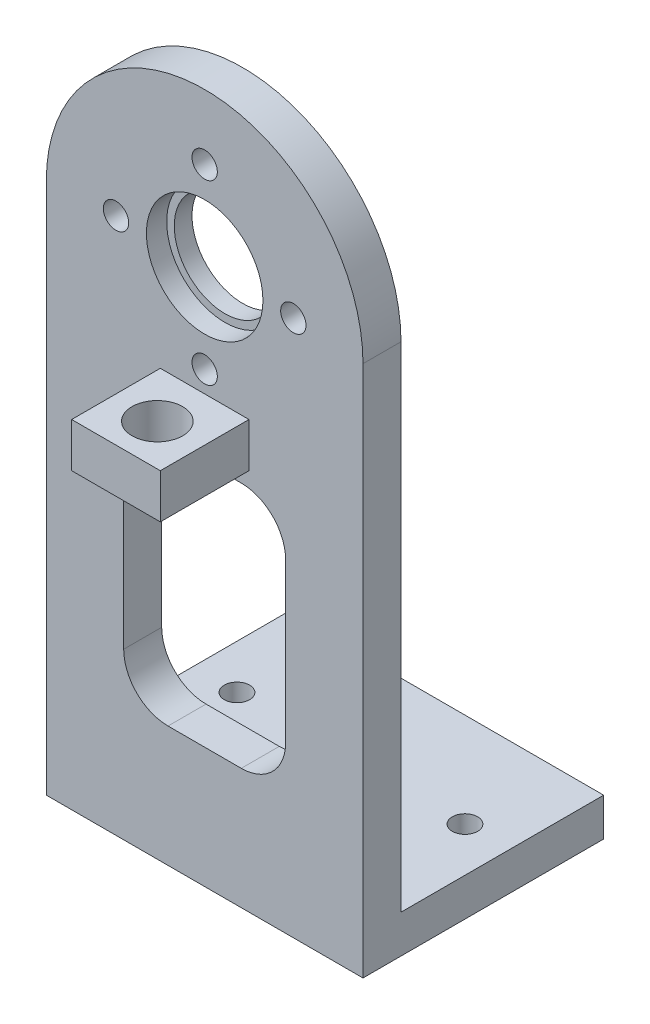
ISO-10303-21;
HEADER;
FILE_DESCRIPTION(('STEP AP214'),'2;1');
FILE_NAME('part.step','',(''),(''),'','','');
FILE_SCHEMA(('AUTOMOTIVE_DESIGN { 1 0 10303 214 1 1 1 1 }'));
ENDSEC;
DATA;
#1=APPLICATION_CONTEXT('core data for automotive mechanical design processes');
#2=APPLICATION_PROTOCOL_DEFINITION('international standard','automotive_design',2000,#1);
#3=PRODUCT_CONTEXT('',#1,'mechanical');
#4=PRODUCT('Part','Part','',(#3));
#5=PRODUCT_RELATED_PRODUCT_CATEGORY('part','',(#4));
#6=PRODUCT_DEFINITION_FORMATION('','',#4);
#7=PRODUCT_DEFINITION_CONTEXT('part definition',#1,'design');
#8=PRODUCT_DEFINITION('design','',#6,#7);
#9=PRODUCT_DEFINITION_SHAPE('','',#8);
#10=(LENGTH_UNIT() NAMED_UNIT(*) SI_UNIT(.MILLI.,.METRE.));
#11=(NAMED_UNIT(*) PLANE_ANGLE_UNIT() SI_UNIT($,.RADIAN.));
#12=(NAMED_UNIT(*) SI_UNIT($,.STERADIAN.) SOLID_ANGLE_UNIT());
#13=UNCERTAINTY_MEASURE_WITH_UNIT(LENGTH_MEASURE(1.E-05),#10,'distance_accuracy_value','');
#14=(GEOMETRIC_REPRESENTATION_CONTEXT(3) GLOBAL_UNCERTAINTY_ASSIGNED_CONTEXT((#13)) GLOBAL_UNIT_ASSIGNED_CONTEXT((#10,
#11,#12)) REPRESENTATION_CONTEXT('',''));
#15=CARTESIAN_POINT('',(0.,0.,0.));
#16=DIRECTION('',(0.,0.,1.));
#17=DIRECTION('',(1.,0.,0.));
#18=AXIS2_PLACEMENT_3D('',#15,#16,#17);
#19=CARTESIAN_POINT('',(0.,0.,3.));
#20=DIRECTION('',(0.,0.,1.));
#21=DIRECTION('',(1.,0.,0.));
#22=AXIS2_PLACEMENT_3D('',#19,#20,#21);
#23=PLANE('',#22);
#24=DIRECTION('',(1.,0.,0.));
#25=VECTOR('',#24,1.);
#26=CARTESIAN_POINT('',(0.,-14.5645587767016,3.));
#27=LINE('',#26,#25);
#28=CARTESIAN_POINT('',(-12.5,-14.5645587767016,3.));
#29=VERTEX_POINT('',#28);
#30=CARTESIAN_POINT('',(12.5,-14.5645587767016,3.));
#31=VERTEX_POINT('',#30);
#32=EDGE_CURVE('E292',#29,#31,#27,.T.);
#33=ORIENTED_EDGE('',*,*,#32,.T.);
#34=DIRECTION('',(0.,-1.,0.));
#35=VECTOR('',#34,1.);
#36=CARTESIAN_POINT('',(12.5,0.,3.));
#37=LINE('',#36,#35);
#38=CARTESIAN_POINT('',(12.5,27.4354412232984,3.));
#39=VERTEX_POINT('',#38);
#40=EDGE_CURVE('E285',#39,#31,#37,.T.);
#41=ORIENTED_EDGE('',*,*,#40,.F.);
#42=CARTESIAN_POINT('',(0.,27.4354412232984,3.));
#43=DIRECTION('',(0.,0.,1.));
#44=DIRECTION('',(1.,0.,0.));
#45=AXIS2_PLACEMENT_3D('',#42,#43,#44);
#46=CIRCLE('',#45,12.5);
#47=CARTESIAN_POINT('',(-12.5,27.4354412232984,3.));
#48=VERTEX_POINT('',#47);
#49=EDGE_CURVE('E287',#39,#48,#46,.T.);
#50=ORIENTED_EDGE('',*,*,#49,.T.);
#51=DIRECTION('',(0.,-1.,0.));
#52=VECTOR('',#51,1.);
#53=CARTESIAN_POINT('',(-12.5,0.,3.));
#54=LINE('',#53,#52);
#55=EDGE_CURVE('E290',#48,#29,#54,.T.);
#56=ORIENTED_EDGE('',*,*,#55,.T.);
#57=EDGE_LOOP('',(#33,#41,#50,#56));
#58=FACE_BOUND('',#57,.T.);
#59=CARTESIAN_POINT('',(0.,27.8020491594206,3.));
#60=DIRECTION('',(0.,0.,1.));
#61=DIRECTION('',(1.,0.,0.));
#62=AXIS2_PLACEMENT_3D('',#59,#60,#61);
#63=CIRCLE('',#62,4.6);
#64=CARTESIAN_POINT('',(4.6,27.8020491594206,3.));
#65=VERTEX_POINT('',#64);
#66=EDGE_CURVE('E248',#65,#65,#63,.T.);
#67=ORIENTED_EDGE('',*,*,#66,.F.);
#68=EDGE_LOOP('',(#67));
#69=FACE_BOUND('',#68,.T.);
#70=CARTESIAN_POINT('',(0.,20.8020491594206,3.));
#71=DIRECTION('',(0.,0.,1.));
#72=DIRECTION('',(1.,0.,0.));
#73=AXIS2_PLACEMENT_3D('',#70,#71,#72);
#74=CIRCLE('',#73,1.);
#75=CARTESIAN_POINT('',(1.,20.8020491594206,3.));
#76=VERTEX_POINT('',#75);
#77=EDGE_CURVE('E261',#76,#76,#74,.T.);
#78=ORIENTED_EDGE('',*,*,#77,.F.);
#79=EDGE_LOOP('',(#78));
#80=FACE_BOUND('',#79,.T.);
#81=CARTESIAN_POINT('',(-7.,27.8020491594206,3.));
#82=DIRECTION('',(0.,0.,1.));
#83=DIRECTION('',(1.,0.,0.));
#84=AXIS2_PLACEMENT_3D('',#81,#82,#83);
#85=CIRCLE('',#84,1.);
#86=CARTESIAN_POINT('',(-6.,27.8020491594206,3.));
#87=VERTEX_POINT('',#86);
#88=EDGE_CURVE('E274',#87,#87,#85,.T.);
#89=ORIENTED_EDGE('',*,*,#88,.F.);
#90=EDGE_LOOP('',(#89));
#91=FACE_BOUND('',#90,.T.);
#92=CARTESIAN_POINT('',(0.,34.8020491594206,3.));
#93=DIRECTION('',(0.,0.,1.));
#94=DIRECTION('',(1.,0.,0.));
#95=AXIS2_PLACEMENT_3D('',#92,#93,#94);
#96=CIRCLE('',#95,1.);
#97=CARTESIAN_POINT('',(1.,34.8020491594206,3.));
#98=VERTEX_POINT('',#97);
#99=EDGE_CURVE('E267',#98,#98,#96,.T.);
#100=ORIENTED_EDGE('',*,*,#99,.F.);
#101=EDGE_LOOP('',(#100));
#102=FACE_BOUND('',#101,.T.);
#103=CARTESIAN_POINT('',(7.,27.8020491594206,3.));
#104=DIRECTION('',(0.,0.,1.));
#105=DIRECTION('',(1.,0.,0.));
#106=AXIS2_PLACEMENT_3D('',#103,#104,#105);
#107=CIRCLE('',#106,1.);
#108=CARTESIAN_POINT('',(8.,27.8020491594206,3.));
#109=VERTEX_POINT('',#108);
#110=EDGE_CURVE('E270',#109,#109,#107,.T.);
#111=ORIENTED_EDGE('',*,*,#110,.F.);
#112=EDGE_LOOP('',(#111));
#113=FACE_BOUND('',#112,.T.);
#114=DIRECTION('',(0.,-1.,0.));
#115=VECTOR('',#114,1.);
#116=CARTESIAN_POINT('',(-6.39192660681687,0.,3.));
#117=LINE('',#116,#115);
#118=CARTESIAN_POINT('',(-6.39192660681687,10.9669786390167,3.));
#119=VERTEX_POINT('',#118);
#120=CARTESIAN_POINT('',(-6.39192660681687,-1.53302136098327,3.));
#121=VERTEX_POINT('',#120);
#122=EDGE_CURVE('E204',#119,#121,#117,.T.);
#123=ORIENTED_EDGE('',*,*,#122,.F.);
#124=CARTESIAN_POINT('',(-2.89192660681687,10.9669786390167,3.));
#125=DIRECTION('',(0.,0.,1.));
#126=DIRECTION('',(1.,0.,0.));
#127=AXIS2_PLACEMENT_3D('',#124,#125,#126);
#128=CIRCLE('',#127,3.5);
#129=CARTESIAN_POINT('',(-2.89192660681687,14.4669786390167,3.));
#130=VERTEX_POINT('',#129);
#131=EDGE_CURVE('E55',#119,#130,#128,.F.);
#132=ORIENTED_EDGE('',*,*,#131,.T.);
#133=DIRECTION('',(1.,0.,0.));
#134=VECTOR('',#133,1.);
#135=CARTESIAN_POINT('',(0.,14.4669786390167,3.));
#136=LINE('',#135,#134);
#137=CARTESIAN_POINT('',(2.89192660681686,14.4669786390167,3.));
#138=VERTEX_POINT('',#137);
#139=EDGE_CURVE('E196',#130,#138,#136,.T.);
#140=ORIENTED_EDGE('',*,*,#139,.T.);
#141=CARTESIAN_POINT('',(2.89192660681686,10.9669786390167,3.));
#142=DIRECTION('',(0.,0.,1.));
#143=DIRECTION('',(1.,0.,0.));
#144=AXIS2_PLACEMENT_3D('',#141,#142,#143);
#145=CIRCLE('',#144,3.5);
#146=CARTESIAN_POINT('',(6.39192660681686,10.9669786390167,3.));
#147=VERTEX_POINT('',#146);
#148=EDGE_CURVE('E342',#138,#147,#145,.F.);
#149=ORIENTED_EDGE('',*,*,#148,.T.);
#150=DIRECTION('',(0.,-1.,0.));
#151=VECTOR('',#150,1.);
#152=CARTESIAN_POINT('',(6.39192660681687,0.,3.));
#153=LINE('',#152,#151);
#154=CARTESIAN_POINT('',(6.39192660681687,-1.53302136098327,3.));
#155=VERTEX_POINT('',#154);
#156=EDGE_CURVE('E193',#147,#155,#153,.T.);
#157=ORIENTED_EDGE('',*,*,#156,.T.);
#158=CARTESIAN_POINT('',(2.89192660681687,-1.53302136098327,3.));
#159=DIRECTION('',(0.,0.,1.));
#160=DIRECTION('',(1.,0.,0.));
#161=AXIS2_PLACEMENT_3D('',#158,#159,#160);
#162=CIRCLE('',#161,3.5);
#163=CARTESIAN_POINT('',(2.89192660681687,-5.03302136098327,3.));
#164=VERTEX_POINT('',#163);
#165=EDGE_CURVE('E338',#155,#164,#162,.F.);
#166=ORIENTED_EDGE('',*,*,#165,.T.);
#167=DIRECTION('',(1.,0.,0.));
#168=VECTOR('',#167,1.);
#169=CARTESIAN_POINT('',(0.,-5.03302136098327,3.));
#170=LINE('',#169,#168);
#171=CARTESIAN_POINT('',(-2.89192660681687,-5.03302136098327,3.));
#172=VERTEX_POINT('',#171);
#173=EDGE_CURVE('E207',#172,#164,#170,.T.);
#174=ORIENTED_EDGE('',*,*,#173,.F.);
#175=CARTESIAN_POINT('',(-2.89192660681687,-1.53302136098327,3.));
#176=DIRECTION('',(0.,0.,1.));
#177=DIRECTION('',(1.,0.,0.));
#178=AXIS2_PLACEMENT_3D('',#175,#176,#177);
#179=CIRCLE('',#178,3.5);
#180=EDGE_CURVE('E334',#172,#121,#179,.F.);
#181=ORIENTED_EDGE('',*,*,#180,.T.);
#182=EDGE_LOOP('',(#123,#132,#140,#149,#157,#166,#174,#181));
#183=FACE_BOUND('',#182,.T.);
#184=DIRECTION('',(1.,0.,0.));
#185=VECTOR('',#184,1.);
#186=CARTESIAN_POINT('',(-3.5,15.6193269973825,3.));
#187=LINE('',#186,#185);
#188=CARTESIAN_POINT('',(-3.5,15.6193269973825,3.));
#189=VERTEX_POINT('',#188);
#190=CARTESIAN_POINT('',(3.5,15.6193269973825,3.));
#191=VERTEX_POINT('',#190);
#192=EDGE_CURVE('E62',#189,#191,#187,.T.);
#193=ORIENTED_EDGE('',*,*,#192,.F.);
#194=DIRECTION('',(0.,-1.,0.));
#195=VECTOR('',#194,1.);
#196=CARTESIAN_POINT('',(-3.5,19.1193269973825,3.));
#197=LINE('',#196,#195);
#198=CARTESIAN_POINT('',(-3.5,19.1193269973825,3.));
#199=VERTEX_POINT('',#198);
#200=EDGE_CURVE('E192',#199,#189,#197,.T.);
#201=ORIENTED_EDGE('',*,*,#200,.F.);
#202=DIRECTION('',(1.,0.,0.));
#203=VECTOR('',#202,1.);
#204=CARTESIAN_POINT('',(-3.5,19.1193269973825,3.));
#205=LINE('',#204,#203);
#206=CARTESIAN_POINT('',(3.5,19.1193269973825,3.));
#207=VERTEX_POINT('',#206);
#208=EDGE_CURVE('E189',#199,#207,#205,.T.);
#209=ORIENTED_EDGE('',*,*,#208,.T.);
#210=DIRECTION('',(0.,-1.,0.));
#211=VECTOR('',#210,1.);
#212=CARTESIAN_POINT('',(3.5,19.1193269973825,3.));
#213=LINE('',#212,#211);
#214=EDGE_CURVE('E67',#207,#191,#213,.T.);
#215=ORIENTED_EDGE('',*,*,#214,.T.);
#216=EDGE_LOOP('',(#193,#201,#209,#215));
#217=FACE_BOUND('',#216,.T.);
#218=ADVANCED_FACE('F47',(#58,#69,#80,#91,#102,#113,#183,#217),#23,.T.);
#219=CARTESIAN_POINT('',(0.,0.,0.));
#220=DIRECTION('',(0.,0.,1.));
#221=DIRECTION('',(1.,0.,0.));
#222=AXIS2_PLACEMENT_3D('',#219,#220,#221);
#223=PLANE('',#222);
#224=DIRECTION('',(1.,0.,0.));
#225=VECTOR('',#224,1.);
#226=CARTESIAN_POINT('',(0.,-11.5645587767016,0.));
#227=LINE('',#226,#225);
#228=CARTESIAN_POINT('',(-12.5,-11.5645587767016,0.));
#229=VERTEX_POINT('',#228);
#230=CARTESIAN_POINT('',(12.5,-11.5645587767016,0.));
#231=VERTEX_POINT('',#230);
#232=EDGE_CURVE('E310',#229,#231,#227,.T.);
#233=ORIENTED_EDGE('',*,*,#232,.F.);
#234=DIRECTION('',(0.,-1.,0.));
#235=VECTOR('',#234,1.);
#236=CARTESIAN_POINT('',(-12.5,0.,0.));
#237=LINE('',#236,#235);
#238=CARTESIAN_POINT('',(-12.5,27.4354412232984,0.));
#239=VERTEX_POINT('',#238);
#240=EDGE_CURVE('E288',#239,#229,#237,.T.);
#241=ORIENTED_EDGE('',*,*,#240,.F.);
#242=CARTESIAN_POINT('',(0.,27.4354412232984,0.));
#243=DIRECTION('',(0.,0.,1.));
#244=DIRECTION('',(1.,0.,0.));
#245=AXIS2_PLACEMENT_3D('',#242,#243,#244);
#246=CIRCLE('',#245,12.5);
#247=CARTESIAN_POINT('',(12.5,27.4354412232984,0.));
#248=VERTEX_POINT('',#247);
#249=EDGE_CURVE('E298',#248,#239,#246,.T.);
#250=ORIENTED_EDGE('',*,*,#249,.F.);
#251=DIRECTION('',(0.,-1.,0.));
#252=VECTOR('',#251,1.);
#253=CARTESIAN_POINT('',(12.5,0.,0.));
#254=LINE('',#253,#252);
#255=EDGE_CURVE('E282',#248,#231,#254,.T.);
#256=ORIENTED_EDGE('',*,*,#255,.T.);
#257=EDGE_LOOP('',(#233,#241,#250,#256));
#258=FACE_BOUND('',#257,.T.);
#259=CARTESIAN_POINT('',(0.,20.8020491594206,0.));
#260=DIRECTION('',(0.,0.,1.));
#261=DIRECTION('',(1.,0.,0.));
#262=AXIS2_PLACEMENT_3D('',#259,#260,#261);
#263=CIRCLE('',#262,1.);
#264=CARTESIAN_POINT('',(1.,20.8020491594206,0.));
#265=VERTEX_POINT('',#264);
#266=EDGE_CURVE('E264',#265,#265,#263,.T.);
#267=ORIENTED_EDGE('',*,*,#266,.T.);
#268=EDGE_LOOP('',(#267));
#269=FACE_BOUND('',#268,.T.);
#270=CARTESIAN_POINT('',(0.,27.8020491594206,0.));
#271=DIRECTION('',(0.,0.,1.));
#272=DIRECTION('',(1.,0.,0.));
#273=AXIS2_PLACEMENT_3D('',#270,#271,#272);
#274=CIRCLE('',#273,4.);
#275=CARTESIAN_POINT('',(4.,27.8020491594206,0.));
#276=VERTEX_POINT('',#275);
#277=EDGE_CURVE('E257',#276,#276,#274,.T.);
#278=ORIENTED_EDGE('',*,*,#277,.T.);
#279=EDGE_LOOP('',(#278));
#280=FACE_BOUND('',#279,.T.);
#281=CARTESIAN_POINT('',(-7.,27.8020491594206,0.));
#282=DIRECTION('',(0.,0.,1.));
#283=DIRECTION('',(1.,0.,0.));
#284=AXIS2_PLACEMENT_3D('',#281,#282,#283);
#285=CIRCLE('',#284,1.);
#286=CARTESIAN_POINT('',(-6.,27.8020491594206,0.));
#287=VERTEX_POINT('',#286);
#288=EDGE_CURVE('E260',#287,#287,#285,.T.);
#289=ORIENTED_EDGE('',*,*,#288,.T.);
#290=EDGE_LOOP('',(#289));
#291=FACE_BOUND('',#290,.T.);
#292=CARTESIAN_POINT('',(0.,34.8020491594206,0.));
#293=DIRECTION('',(0.,0.,1.));
#294=DIRECTION('',(1.,0.,0.));
#295=AXIS2_PLACEMENT_3D('',#292,#293,#294);
#296=CIRCLE('',#295,1.);
#297=CARTESIAN_POINT('',(1.,34.8020491594206,0.));
#298=VERTEX_POINT('',#297);
#299=EDGE_CURVE('E271',#298,#298,#296,.T.);
#300=ORIENTED_EDGE('',*,*,#299,.T.);
#301=EDGE_LOOP('',(#300));
#302=FACE_BOUND('',#301,.T.);
#303=CARTESIAN_POINT('',(7.,27.8020491594206,0.));
#304=DIRECTION('',(0.,0.,1.));
#305=DIRECTION('',(1.,0.,0.));
#306=AXIS2_PLACEMENT_3D('',#303,#304,#305);
#307=CIRCLE('',#306,1.);
#308=CARTESIAN_POINT('',(8.,27.8020491594206,0.));
#309=VERTEX_POINT('',#308);
#310=EDGE_CURVE('E279',#309,#309,#307,.T.);
#311=ORIENTED_EDGE('',*,*,#310,.T.);
#312=EDGE_LOOP('',(#311));
#313=FACE_BOUND('',#312,.T.);
#314=DIRECTION('',(0.,-1.,0.));
#315=VECTOR('',#314,1.);
#316=CARTESIAN_POINT('',(6.39192660681687,0.,0.));
#317=LINE('',#316,#315);
#318=CARTESIAN_POINT('',(6.39192660681686,10.9669786390167,0.));
#319=VERTEX_POINT('',#318);
#320=CARTESIAN_POINT('',(6.39192660681687,-1.53302136098327,0.));
#321=VERTEX_POINT('',#320);
#322=EDGE_CURVE('E219',#319,#321,#317,.T.);
#323=ORIENTED_EDGE('',*,*,#322,.F.);
#324=CARTESIAN_POINT('',(2.89192660681686,10.9669786390167,0.));
#325=DIRECTION('',(0.,0.,1.));
#326=DIRECTION('',(1.,0.,0.));
#327=AXIS2_PLACEMENT_3D('',#324,#325,#326);
#328=CIRCLE('',#327,3.5);
#329=CARTESIAN_POINT('',(2.89192660681686,14.4669786390167,0.));
#330=VERTEX_POINT('',#329);
#331=EDGE_CURVE('E344',#319,#330,#328,.T.);
#332=ORIENTED_EDGE('',*,*,#331,.T.);
#333=DIRECTION('',(1.,0.,0.));
#334=VECTOR('',#333,1.);
#335=CARTESIAN_POINT('',(0.,14.4669786390167,0.));
#336=LINE('',#335,#334);
#337=CARTESIAN_POINT('',(-2.89192660681687,14.4669786390167,0.));
#338=VERTEX_POINT('',#337);
#339=EDGE_CURVE('E210',#338,#330,#336,.T.);
#340=ORIENTED_EDGE('',*,*,#339,.F.);
#341=CARTESIAN_POINT('',(-2.89192660681687,10.9669786390167,0.));
#342=DIRECTION('',(0.,0.,1.));
#343=DIRECTION('',(1.,0.,0.));
#344=AXIS2_PLACEMENT_3D('',#341,#342,#343);
#345=CIRCLE('',#344,3.5);
#346=CARTESIAN_POINT('',(-6.39192660681687,10.9669786390167,0.));
#347=VERTEX_POINT('',#346);
#348=EDGE_CURVE('E12',#338,#347,#345,.T.);
#349=ORIENTED_EDGE('',*,*,#348,.T.);
#350=DIRECTION('',(0.,-1.,0.));
#351=VECTOR('',#350,1.);
#352=CARTESIAN_POINT('',(-6.39192660681687,0.,0.));
#353=LINE('',#352,#351);
#354=CARTESIAN_POINT('',(-6.39192660681687,-1.53302136098327,0.));
#355=VERTEX_POINT('',#354);
#356=EDGE_CURVE('E213',#347,#355,#353,.T.);
#357=ORIENTED_EDGE('',*,*,#356,.T.);
#358=CARTESIAN_POINT('',(-2.89192660681687,-1.53302136098327,0.));
#359=DIRECTION('',(0.,0.,1.));
#360=DIRECTION('',(1.,0.,0.));
#361=AXIS2_PLACEMENT_3D('',#358,#359,#360);
#362=CIRCLE('',#361,3.5);
#363=CARTESIAN_POINT('',(-2.89192660681687,-5.03302136098327,0.));
#364=VERTEX_POINT('',#363);
#365=EDGE_CURVE('E336',#355,#364,#362,.T.);
#366=ORIENTED_EDGE('',*,*,#365,.T.);
#367=DIRECTION('',(1.,0.,0.));
#368=VECTOR('',#367,1.);
#369=CARTESIAN_POINT('',(0.,-5.03302136098327,0.));
#370=LINE('',#369,#368);
#371=CARTESIAN_POINT('',(2.89192660681687,-5.03302136098327,0.));
#372=VERTEX_POINT('',#371);
#373=EDGE_CURVE('E216',#364,#372,#370,.T.);
#374=ORIENTED_EDGE('',*,*,#373,.T.);
#375=CARTESIAN_POINT('',(2.89192660681687,-1.53302136098327,0.));
#376=DIRECTION('',(0.,0.,1.));
#377=DIRECTION('',(1.,0.,0.));
#378=AXIS2_PLACEMENT_3D('',#375,#376,#377);
#379=CIRCLE('',#378,3.5);
#380=EDGE_CURVE('E340',#372,#321,#379,.T.);
#381=ORIENTED_EDGE('',*,*,#380,.T.);
#382=EDGE_LOOP('',(#323,#332,#340,#349,#357,#366,#374,#381));
#383=FACE_BOUND('',#382,.T.);
#384=ADVANCED_FACE('F359',(#258,#269,#280,#291,#302,#313,#383),#223,.F.);
#385=CARTESIAN_POINT('',(0.,27.8020491594206,0.));
#386=DIRECTION('',(0.,0.,1.));
#387=DIRECTION('',(1.,0.,0.));
#388=AXIS2_PLACEMENT_3D('',#385,#386,#387);
#389=CYLINDRICAL_SURFACE('',#388,4.);
#390=ORIENTED_EDGE('',*,*,#277,.F.);
#391=EDGE_LOOP('',(#390));
#392=FACE_BOUND('',#391,.T.);
#393=CARTESIAN_POINT('',(0.,27.8020491594206,1.4));
#394=DIRECTION('',(0.,0.,1.));
#395=DIRECTION('',(1.,0.,0.));
#396=AXIS2_PLACEMENT_3D('',#393,#394,#395);
#397=CIRCLE('',#396,4.);
#398=CARTESIAN_POINT('',(4.,27.8020491594206,1.4));
#399=VERTEX_POINT('',#398);
#400=EDGE_CURVE('E254',#399,#399,#397,.F.);
#401=ORIENTED_EDGE('',*,*,#400,.F.);
#402=EDGE_LOOP('',(#401));
#403=FACE_BOUND('',#402,.T.);
#404=ADVANCED_FACE('F395',(#392,#403),#389,.F.);
#405=CARTESIAN_POINT('',(12.5,0.,3.));
#406=DIRECTION('',(1.,0.,0.));
#407=DIRECTION('',(0.,1.,0.));
#408=AXIS2_PLACEMENT_3D('',#405,#406,#407);
#409=PLANE('',#408);
#410=DIRECTION('',(0.,0.,1.));
#411=VECTOR('',#410,1.);
#412=CARTESIAN_POINT('',(12.5,-11.5645587767016,-16.));
#413=LINE('',#412,#411);
#414=CARTESIAN_POINT('',(12.5,-11.5645587767016,-16.));
#415=VERTEX_POINT('',#414);
#416=EDGE_CURVE('E245',#415,#231,#413,.T.);
#417=ORIENTED_EDGE('',*,*,#416,.T.);
#418=ORIENTED_EDGE('',*,*,#255,.F.);
#419=DIRECTION('',(0.,0.,-1.));
#420=VECTOR('',#419,1.);
#421=CARTESIAN_POINT('',(12.5,27.4354412232984,3.));
#422=LINE('',#421,#420);
#423=EDGE_CURVE('E308',#39,#248,#422,.T.);
#424=ORIENTED_EDGE('',*,*,#423,.F.);
#425=ORIENTED_EDGE('',*,*,#40,.T.);
#426=DIRECTION('',(0.,0.,-1.));
#427=VECTOR('',#426,1.);
#428=CARTESIAN_POINT('',(12.5,-14.5645587767016,3.));
#429=LINE('',#428,#427);
#430=CARTESIAN_POINT('',(12.5,-14.5645587767016,-16.));
#431=VERTEX_POINT('',#430);
#432=EDGE_CURVE('E295',#31,#431,#429,.T.);
#433=ORIENTED_EDGE('',*,*,#432,.T.);
#434=DIRECTION('',(0.,1.,0.));
#435=VECTOR('',#434,1.);
#436=CARTESIAN_POINT('',(12.5,-14.5645587767016,-16.));
#437=LINE('',#436,#435);
#438=EDGE_CURVE('E240',#431,#415,#437,.T.);
#439=ORIENTED_EDGE('',*,*,#438,.T.);
#440=EDGE_LOOP('',(#417,#418,#424,#425,#433,#439));
#441=FACE_BOUND('',#440,.T.);
#442=ADVANCED_FACE('F414',(#441),#409,.T.);
#443=CARTESIAN_POINT('',(0.,27.4354412232984,3.));
#444=DIRECTION('',(0.,0.,-1.));
#445=DIRECTION('',(-1.,0.,0.));
#446=AXIS2_PLACEMENT_3D('',#443,#444,#445);
#447=CYLINDRICAL_SURFACE('',#446,12.5);
#448=ORIENTED_EDGE('',*,*,#249,.T.);
#449=DIRECTION('',(0.,0.,-1.));
#450=VECTOR('',#449,1.);
#451=CARTESIAN_POINT('',(-12.5,27.4354412232984,3.));
#452=LINE('',#451,#450);
#453=EDGE_CURVE('E305',#48,#239,#452,.T.);
#454=ORIENTED_EDGE('',*,*,#453,.F.);
#455=ORIENTED_EDGE('',*,*,#49,.F.);
#456=ORIENTED_EDGE('',*,*,#423,.T.);
#457=EDGE_LOOP('',(#448,#454,#455,#456));
#458=FACE_BOUND('',#457,.T.);
#459=ADVANCED_FACE('F410',(#458),#447,.T.);
#460=CARTESIAN_POINT('',(-12.5,0.,3.));
#461=DIRECTION('',(1.,0.,0.));
#462=DIRECTION('',(0.,1.,0.));
#463=AXIS2_PLACEMENT_3D('',#460,#461,#462);
#464=PLANE('',#463);
#465=DIRECTION('',(0.,0.,-1.));
#466=VECTOR('',#465,1.);
#467=CARTESIAN_POINT('',(-12.5,-14.5645587767016,3.));
#468=LINE('',#467,#466);
#469=CARTESIAN_POINT('',(-12.5,-14.5645587767016,-16.));
#470=VERTEX_POINT('',#469);
#471=EDGE_CURVE('E303',#29,#470,#468,.T.);
#472=ORIENTED_EDGE('',*,*,#471,.F.);
#473=ORIENTED_EDGE('',*,*,#55,.F.);
#474=ORIENTED_EDGE('',*,*,#453,.T.);
#475=ORIENTED_EDGE('',*,*,#240,.T.);
#476=DIRECTION('',(0.,0.,1.));
#477=VECTOR('',#476,1.);
#478=CARTESIAN_POINT('',(-12.5,-11.5645587767016,-16.));
#479=LINE('',#478,#477);
#480=CARTESIAN_POINT('',(-12.5,-11.5645587767016,-16.));
#481=VERTEX_POINT('',#480);
#482=EDGE_CURVE('E246',#481,#229,#479,.T.);
#483=ORIENTED_EDGE('',*,*,#482,.F.);
#484=DIRECTION('',(0.,-1.,0.));
#485=VECTOR('',#484,1.);
#486=CARTESIAN_POINT('',(-12.5,-11.5645587767016,-16.));
#487=LINE('',#486,#485);
#488=EDGE_CURVE('E234',#481,#470,#487,.T.);
#489=ORIENTED_EDGE('',*,*,#488,.T.);
#490=EDGE_LOOP('',(#472,#473,#474,#475,#483,#489));
#491=FACE_BOUND('',#490,.T.);
#492=ADVANCED_FACE('F406',(#491),#464,.F.);
#493=CARTESIAN_POINT('',(0.,-14.5645587767016,3.));
#494=DIRECTION('',(0.,1.,0.));
#495=DIRECTION('',(-1.,0.,0.));
#496=AXIS2_PLACEMENT_3D('',#493,#494,#495);
#497=PLANE('',#496);
#498=CARTESIAN_POINT('',(-9.,-14.5645587767016,-8.55));
#499=DIRECTION('',(0.,1.,0.));
#500=DIRECTION('',(-1.,0.,0.));
#501=AXIS2_PLACEMENT_3D('',#498,#499,#500);
#502=CIRCLE('',#501,0.999999999999999);
#503=CARTESIAN_POINT('',(-10.,-14.5645587767016,-8.55));
#504=VERTEX_POINT('',#503);
#505=EDGE_CURVE('E225',#504,#504,#502,.T.);
#506=ORIENTED_EDGE('',*,*,#505,.T.);
#507=EDGE_LOOP('',(#506));
#508=FACE_BOUND('',#507,.T.);
#509=CARTESIAN_POINT('',(9.,-14.5645587767016,-8.55));
#510=DIRECTION('',(0.,1.,0.));
#511=DIRECTION('',(-1.,0.,0.));
#512=AXIS2_PLACEMENT_3D('',#509,#510,#511);
#513=CIRCLE('',#512,1.);
#514=CARTESIAN_POINT('',(8.,-14.5645587767016,-8.55));
#515=VERTEX_POINT('',#514);
#516=EDGE_CURVE('E231',#515,#515,#513,.T.);
#517=ORIENTED_EDGE('',*,*,#516,.T.);
#518=EDGE_LOOP('',(#517));
#519=FACE_BOUND('',#518,.T.);
#520=ORIENTED_EDGE('',*,*,#471,.T.);
#521=DIRECTION('',(1.,0.,0.));
#522=VECTOR('',#521,1.);
#523=CARTESIAN_POINT('',(-12.5,-14.5645587767016,-16.));
#524=LINE('',#523,#522);
#525=EDGE_CURVE('E237',#470,#431,#524,.T.);
#526=ORIENTED_EDGE('',*,*,#525,.T.);
#527=ORIENTED_EDGE('',*,*,#432,.F.);
#528=ORIENTED_EDGE('',*,*,#32,.F.);
#529=EDGE_LOOP('',(#520,#526,#527,#528));
#530=FACE_BOUND('',#529,.T.);
#531=ADVANCED_FACE('F403',(#508,#519,#530),#497,.F.);
#532=CARTESIAN_POINT('',(7.,27.8020491594206,0.));
#533=DIRECTION('',(0.,0.,1.));
#534=DIRECTION('',(1.,0.,0.));
#535=AXIS2_PLACEMENT_3D('',#532,#533,#534);
#536=CYLINDRICAL_SURFACE('',#535,1.);
#537=ORIENTED_EDGE('',*,*,#310,.F.);
#538=EDGE_LOOP('',(#537));
#539=FACE_BOUND('',#538,.T.);
#540=ORIENTED_EDGE('',*,*,#110,.T.);
#541=EDGE_LOOP('',(#540));
#542=FACE_BOUND('',#541,.T.);
#543=ADVANCED_FACE('F400',(#539,#542),#536,.F.);
#544=CARTESIAN_POINT('',(0.,34.8020491594206,0.));
#545=DIRECTION('',(0.,0.,1.));
#546=DIRECTION('',(1.,0.,0.));
#547=AXIS2_PLACEMENT_3D('',#544,#545,#546);
#548=CYLINDRICAL_SURFACE('',#547,1.);
#549=ORIENTED_EDGE('',*,*,#299,.F.);
#550=EDGE_LOOP('',(#549));
#551=FACE_BOUND('',#550,.T.);
#552=ORIENTED_EDGE('',*,*,#99,.T.);
#553=EDGE_LOOP('',(#552));
#554=FACE_BOUND('',#553,.T.);
#555=ADVANCED_FACE('F464',(#551,#554),#548,.F.);
#556=CARTESIAN_POINT('',(-7.,27.8020491594206,0.));
#557=DIRECTION('',(0.,0.,1.));
#558=DIRECTION('',(1.,0.,0.));
#559=AXIS2_PLACEMENT_3D('',#556,#557,#558);
#560=CYLINDRICAL_SURFACE('',#559,1.);
#561=ORIENTED_EDGE('',*,*,#288,.F.);
#562=EDGE_LOOP('',(#561));
#563=FACE_BOUND('',#562,.T.);
#564=ORIENTED_EDGE('',*,*,#88,.T.);
#565=EDGE_LOOP('',(#564));
#566=FACE_BOUND('',#565,.T.);
#567=ADVANCED_FACE('F462',(#563,#566),#560,.F.);
#568=CARTESIAN_POINT('',(0.,20.8020491594206,0.));
#569=DIRECTION('',(0.,0.,1.));
#570=DIRECTION('',(1.,0.,0.));
#571=AXIS2_PLACEMENT_3D('',#568,#569,#570);
#572=CYLINDRICAL_SURFACE('',#571,1.);
#573=ORIENTED_EDGE('',*,*,#77,.T.);
#574=EDGE_LOOP('',(#573));
#575=FACE_BOUND('',#574,.T.);
#576=ORIENTED_EDGE('',*,*,#266,.F.);
#577=EDGE_LOOP('',(#576));
#578=FACE_BOUND('',#577,.T.);
#579=ADVANCED_FACE('F452',(#575,#578),#572,.F.);
#580=CARTESIAN_POINT('',(0.,27.8020491594206,1.4));
#581=DIRECTION('',(0.,0.,1.));
#582=DIRECTION('',(1.,0.,0.));
#583=AXIS2_PLACEMENT_3D('',#580,#581,#582);
#584=PLANE('',#583);
#585=CARTESIAN_POINT('',(0.,27.8020491594206,1.4));
#586=DIRECTION('',(0.,0.,1.));
#587=DIRECTION('',(1.,0.,0.));
#588=AXIS2_PLACEMENT_3D('',#585,#586,#587);
#589=CIRCLE('',#588,4.6);
#590=CARTESIAN_POINT('',(4.6,27.8020491594206,1.4));
#591=VERTEX_POINT('',#590);
#592=EDGE_CURVE('E251',#591,#591,#589,.T.);
#593=ORIENTED_EDGE('',*,*,#592,.T.);
#594=EDGE_LOOP('',(#593));
#595=FACE_BOUND('',#594,.T.);
#596=ORIENTED_EDGE('',*,*,#400,.T.);
#597=EDGE_LOOP('',(#596));
#598=FACE_BOUND('',#597,.T.);
#599=ADVANCED_FACE('F449',(#595,#598),#584,.T.);
#600=CARTESIAN_POINT('',(0.,27.8020491594206,1.4));
#601=DIRECTION('',(0.,0.,1.));
#602=DIRECTION('',(1.,0.,0.));
#603=AXIS2_PLACEMENT_3D('',#600,#601,#602);
#604=CYLINDRICAL_SURFACE('',#603,4.6);
#605=ORIENTED_EDGE('',*,*,#592,.F.);
#606=EDGE_LOOP('',(#605));
#607=FACE_BOUND('',#606,.T.);
#608=ORIENTED_EDGE('',*,*,#66,.T.);
#609=EDGE_LOOP('',(#608));
#610=FACE_BOUND('',#609,.T.);
#611=ADVANCED_FACE('F447',(#607,#610),#604,.F.);
#612=CARTESIAN_POINT('',(-12.5,-11.5645587767016,-16.));
#613=DIRECTION('',(0.,-1.,0.));
#614=DIRECTION('',(0.,0.,-1.));
#615=AXIS2_PLACEMENT_3D('',#612,#613,#614);
#616=PLANE('',#615);
#617=CARTESIAN_POINT('',(-9.,-11.5645587767016,-8.55));
#618=DIRECTION('',(0.,1.,0.));
#619=DIRECTION('',(0.,0.,1.));
#620=AXIS2_PLACEMENT_3D('',#617,#618,#619);
#621=CIRCLE('',#620,0.999999999999999);
#622=CARTESIAN_POINT('',(-9.,-11.5645587767016,-7.55));
#623=VERTEX_POINT('',#622);
#624=EDGE_CURVE('E222',#623,#623,#621,.T.);
#625=ORIENTED_EDGE('',*,*,#624,.F.);
#626=EDGE_LOOP('',(#625));
#627=FACE_BOUND('',#626,.T.);
#628=CARTESIAN_POINT('',(9.,-11.5645587767016,-8.55));
#629=DIRECTION('',(0.,1.,0.));
#630=DIRECTION('',(0.,0.,1.));
#631=AXIS2_PLACEMENT_3D('',#628,#629,#630);
#632=CIRCLE('',#631,1.);
#633=CARTESIAN_POINT('',(9.,-11.5645587767016,-7.55));
#634=VERTEX_POINT('',#633);
#635=EDGE_CURVE('E228',#634,#634,#632,.T.);
#636=ORIENTED_EDGE('',*,*,#635,.F.);
#637=EDGE_LOOP('',(#636));
#638=FACE_BOUND('',#637,.T.);
#639=ORIENTED_EDGE('',*,*,#482,.T.);
#640=ORIENTED_EDGE('',*,*,#232,.T.);
#641=ORIENTED_EDGE('',*,*,#416,.F.);
#642=DIRECTION('',(1.,0.,0.));
#643=VECTOR('',#642,1.);
#644=CARTESIAN_POINT('',(-12.5,-11.5645587767016,-16.));
#645=LINE('',#644,#643);
#646=EDGE_CURVE('E243',#481,#415,#645,.T.);
#647=ORIENTED_EDGE('',*,*,#646,.F.);
#648=EDGE_LOOP('',(#639,#640,#641,#647));
#649=FACE_BOUND('',#648,.T.);
#650=ADVANCED_FACE('F443',(#627,#638,#649),#616,.F.);
#651=CARTESIAN_POINT('',(0.,0.,-16.));
#652=DIRECTION('',(0.,0.,1.));
#653=DIRECTION('',(1.,0.,0.));
#654=AXIS2_PLACEMENT_3D('',#651,#652,#653);
#655=PLANE('',#654);
#656=ORIENTED_EDGE('',*,*,#488,.F.);
#657=ORIENTED_EDGE('',*,*,#646,.T.);
#658=ORIENTED_EDGE('',*,*,#438,.F.);
#659=ORIENTED_EDGE('',*,*,#525,.F.);
#660=EDGE_LOOP('',(#656,#657,#658,#659));
#661=FACE_BOUND('',#660,.T.);
#662=ADVANCED_FACE('F439',(#661),#655,.F.);
#663=CARTESIAN_POINT('',(9.,-15.5645587767016,-8.55));
#664=DIRECTION('',(0.,1.,0.));
#665=DIRECTION('',(0.,0.,1.));
#666=AXIS2_PLACEMENT_3D('',#663,#664,#665);
#667=CYLINDRICAL_SURFACE('',#666,1.);
#668=ORIENTED_EDGE('',*,*,#635,.T.);
#669=EDGE_LOOP('',(#668));
#670=FACE_BOUND('',#669,.T.);
#671=ORIENTED_EDGE('',*,*,#516,.F.);
#672=EDGE_LOOP('',(#671));
#673=FACE_BOUND('',#672,.T.);
#674=ADVANCED_FACE('F435',(#670,#673),#667,.F.);
#675=CARTESIAN_POINT('',(-9.,-15.5645587767016,-8.55));
#676=DIRECTION('',(0.,1.,0.));
#677=DIRECTION('',(0.,0.,1.));
#678=AXIS2_PLACEMENT_3D('',#675,#676,#677);
#679=CYLINDRICAL_SURFACE('',#678,0.999999999999999);
#680=ORIENTED_EDGE('',*,*,#624,.T.);
#681=EDGE_LOOP('',(#680));
#682=FACE_BOUND('',#681,.T.);
#683=ORIENTED_EDGE('',*,*,#505,.F.);
#684=EDGE_LOOP('',(#683));
#685=FACE_BOUND('',#684,.T.);
#686=ADVANCED_FACE('F432',(#682,#685),#679,.F.);
#687=CARTESIAN_POINT('',(6.39192660681687,0.,-1.));
#688=DIRECTION('',(-1.,0.,0.));
#689=DIRECTION('',(0.,-1.,0.));
#690=AXIS2_PLACEMENT_3D('',#687,#688,#689);
#691=PLANE('',#690);
#692=ORIENTED_EDGE('',*,*,#322,.T.);
#693=DIRECTION('',(0.,0.,1.));
#694=VECTOR('',#693,1.);
#695=CARTESIAN_POINT('',(6.39192660681687,-1.53302136098327,-1.));
#696=LINE('',#695,#694);
#697=EDGE_CURVE('E326',#321,#155,#696,.T.);
#698=ORIENTED_EDGE('',*,*,#697,.T.);
#699=ORIENTED_EDGE('',*,*,#156,.F.);
#700=DIRECTION('',(0.,0.,1.));
#701=VECTOR('',#700,1.);
#702=CARTESIAN_POINT('',(6.39192660681686,10.9669786390167,0.));
#703=LINE('',#702,#701);
#704=EDGE_CURVE('E324',#147,#319,#703,.F.);
#705=ORIENTED_EDGE('',*,*,#704,.T.);
#706=EDGE_LOOP('',(#692,#698,#699,#705));
#707=FACE_BOUND('',#706,.T.);
#708=ADVANCED_FACE('F378',(#707),#691,.T.);
#709=CARTESIAN_POINT('',(0.,-5.03302136098327,-1.));
#710=DIRECTION('',(0.,-1.,0.));
#711=DIRECTION('',(0.,0.,-1.));
#712=AXIS2_PLACEMENT_3D('',#709,#710,#711);
#713=PLANE('',#712);
#714=ORIENTED_EDGE('',*,*,#373,.F.);
#715=DIRECTION('',(0.,0.,1.));
#716=VECTOR('',#715,1.);
#717=CARTESIAN_POINT('',(-2.89192660681687,-5.03302136098327,3.));
#718=LINE('',#717,#716);
#719=EDGE_CURVE('E316',#364,#172,#718,.T.);
#720=ORIENTED_EDGE('',*,*,#719,.T.);
#721=ORIENTED_EDGE('',*,*,#173,.T.);
#722=DIRECTION('',(0.,0.,1.));
#723=VECTOR('',#722,1.);
#724=CARTESIAN_POINT('',(2.89192660681687,-5.03302136098327,-1.));
#725=LINE('',#724,#723);
#726=EDGE_CURVE('E314',#164,#372,#725,.F.);
#727=ORIENTED_EDGE('',*,*,#726,.T.);
#728=EDGE_LOOP('',(#714,#720,#721,#727));
#729=FACE_BOUND('',#728,.T.);
#730=ADVANCED_FACE('F370',(#729),#713,.F.);
#731=CARTESIAN_POINT('',(-6.39192660681687,0.,-1.));
#732=DIRECTION('',(-1.,0.,0.));
#733=DIRECTION('',(0.,-1.,0.));
#734=AXIS2_PLACEMENT_3D('',#731,#732,#733);
#735=PLANE('',#734);
#736=ORIENTED_EDGE('',*,*,#122,.T.);
#737=DIRECTION('',(0.,0.,1.));
#738=VECTOR('',#737,1.);
#739=CARTESIAN_POINT('',(-6.39192660681687,-1.53302136098327,0.));
#740=LINE('',#739,#738);
#741=EDGE_CURVE('E322',#121,#355,#740,.F.);
#742=ORIENTED_EDGE('',*,*,#741,.T.);
#743=ORIENTED_EDGE('',*,*,#356,.F.);
#744=DIRECTION('',(0.,0.,1.));
#745=VECTOR('',#744,1.);
#746=CARTESIAN_POINT('',(-6.39192660681687,10.9669786390167,-1.));
#747=LINE('',#746,#745);
#748=EDGE_CURVE('E319',#347,#119,#747,.T.);
#749=ORIENTED_EDGE('',*,*,#748,.T.);
#750=EDGE_LOOP('',(#736,#742,#743,#749));
#751=FACE_BOUND('',#750,.T.);
#752=ADVANCED_FACE('F362',(#751),#735,.F.);
#753=CARTESIAN_POINT('',(0.,14.4669786390167,-1.));
#754=DIRECTION('',(0.,-1.,0.));
#755=DIRECTION('',(0.,0.,-1.));
#756=AXIS2_PLACEMENT_3D('',#753,#754,#755);
#757=PLANE('',#756);
#758=ORIENTED_EDGE('',*,*,#339,.T.);
#759=DIRECTION('',(0.,0.,1.));
#760=VECTOR('',#759,1.);
#761=CARTESIAN_POINT('',(2.89192660681686,14.4669786390167,3.));
#762=LINE('',#761,#760);
#763=EDGE_CURVE('E331',#330,#138,#762,.T.);
#764=ORIENTED_EDGE('',*,*,#763,.T.);
#765=ORIENTED_EDGE('',*,*,#139,.F.);
#766=DIRECTION('',(0.,0.,1.));
#767=VECTOR('',#766,1.);
#768=CARTESIAN_POINT('',(-2.89192660681687,14.4669786390167,-1.));
#769=LINE('',#768,#767);
#770=EDGE_CURVE('E329',#130,#338,#769,.F.);
#771=ORIENTED_EDGE('',*,*,#770,.T.);
#772=EDGE_LOOP('',(#758,#764,#765,#771));
#773=FACE_BOUND('',#772,.T.);
#774=ADVANCED_FACE('F352',(#773),#757,.T.);
#775=CARTESIAN_POINT('',(-2.89192660681687,-1.53302136098327,-1.));
#776=DIRECTION('',(0.,0.,-1.));
#777=DIRECTION('',(-1.,0.,0.));
#778=AXIS2_PLACEMENT_3D('',#775,#776,#777);
#779=CYLINDRICAL_SURFACE('',#778,3.5);
#780=ORIENTED_EDGE('',*,*,#365,.F.);
#781=ORIENTED_EDGE('',*,*,#741,.F.);
#782=ORIENTED_EDGE('',*,*,#180,.F.);
#783=ORIENTED_EDGE('',*,*,#719,.F.);
#784=EDGE_LOOP('',(#780,#781,#782,#783));
#785=FACE_BOUND('',#784,.T.);
#786=ADVANCED_FACE('F365',(#785),#779,.F.);
#787=CARTESIAN_POINT('',(2.89192660681687,-1.53302136098327,-1.));
#788=DIRECTION('',(0.,0.,1.));
#789=DIRECTION('',(1.,0.,0.));
#790=AXIS2_PLACEMENT_3D('',#787,#788,#789);
#791=CYLINDRICAL_SURFACE('',#790,3.5);
#792=ORIENTED_EDGE('',*,*,#380,.F.);
#793=ORIENTED_EDGE('',*,*,#726,.F.);
#794=ORIENTED_EDGE('',*,*,#165,.F.);
#795=ORIENTED_EDGE('',*,*,#697,.F.);
#796=EDGE_LOOP('',(#792,#793,#794,#795));
#797=FACE_BOUND('',#796,.T.);
#798=ADVANCED_FACE('F374',(#797),#791,.F.);
#799=CARTESIAN_POINT('',(2.89192660681686,10.9669786390167,-1.));
#800=DIRECTION('',(0.,0.,-1.));
#801=DIRECTION('',(-1.,0.,0.));
#802=AXIS2_PLACEMENT_3D('',#799,#800,#801);
#803=CYLINDRICAL_SURFACE('',#802,3.5);
#804=ORIENTED_EDGE('',*,*,#331,.F.);
#805=ORIENTED_EDGE('',*,*,#704,.F.);
#806=ORIENTED_EDGE('',*,*,#148,.F.);
#807=ORIENTED_EDGE('',*,*,#763,.F.);
#808=EDGE_LOOP('',(#804,#805,#806,#807));
#809=FACE_BOUND('',#808,.T.);
#810=ADVANCED_FACE('F382',(#809),#803,.F.);
#811=CARTESIAN_POINT('',(-2.89192660681687,10.9669786390167,-1.));
#812=DIRECTION('',(0.,0.,1.));
#813=DIRECTION('',(1.,0.,0.));
#814=AXIS2_PLACEMENT_3D('',#811,#812,#813);
#815=CYLINDRICAL_SURFACE('',#814,3.5);
#816=ORIENTED_EDGE('',*,*,#348,.F.);
#817=ORIENTED_EDGE('',*,*,#770,.F.);
#818=ORIENTED_EDGE('',*,*,#131,.F.);
#819=ORIENTED_EDGE('',*,*,#748,.F.);
#820=EDGE_LOOP('',(#816,#817,#818,#819));
#821=FACE_BOUND('',#820,.T.);
#822=ADVANCED_FACE('F49',(#821),#815,.F.);
#823=CARTESIAN_POINT('',(-3.5,19.1193269973825,10.));
#824=DIRECTION('',(1.,0.,0.));
#825=DIRECTION('',(0.,1.,0.));
#826=AXIS2_PLACEMENT_3D('',#823,#824,#825);
#827=PLANE('',#826);
#828=ORIENTED_EDGE('',*,*,#200,.T.);
#829=DIRECTION('',(0.,0.,-1.));
#830=VECTOR('',#829,1.);
#831=CARTESIAN_POINT('',(-3.5,15.6193269973825,10.));
#832=LINE('',#831,#830);
#833=CARTESIAN_POINT('',(-3.5,15.6193269973825,10.));
#834=VERTEX_POINT('',#833);
#835=EDGE_CURVE('E173',#834,#189,#832,.T.);
#836=ORIENTED_EDGE('',*,*,#835,.F.);
#837=DIRECTION('',(0.,-1.,0.));
#838=VECTOR('',#837,1.);
#839=CARTESIAN_POINT('',(-3.5,19.1193269973825,10.));
#840=LINE('',#839,#838);
#841=CARTESIAN_POINT('',(-3.5,19.1193269973825,10.));
#842=VERTEX_POINT('',#841);
#843=EDGE_CURVE('E180',#842,#834,#840,.T.);
#844=ORIENTED_EDGE('',*,*,#843,.F.);
#845=DIRECTION('',(0.,0.,-1.));
#846=VECTOR('',#845,1.);
#847=CARTESIAN_POINT('',(-3.5,19.1193269973825,10.));
#848=LINE('',#847,#846);
#849=EDGE_CURVE('E693',#842,#199,#848,.T.);
#850=ORIENTED_EDGE('',*,*,#849,.T.);
#851=EDGE_LOOP('',(#828,#836,#844,#850));
#852=FACE_BOUND('',#851,.T.);
#853=ADVANCED_FACE('F191',(#852),#827,.F.);
#854=CARTESIAN_POINT('',(-3.5,15.6193269973825,10.));
#855=DIRECTION('',(0.,1.,0.));
#856=DIRECTION('',(0.,0.,1.));
#857=AXIS2_PLACEMENT_3D('',#854,#855,#856);
#858=PLANE('',#857);
#859=CARTESIAN_POINT('',(0.,15.6193269973825,6.73572894056917));
#860=DIRECTION('',(0.,1.,0.));
#861=DIRECTION('',(0.,0.,1.));
#862=AXIS2_PLACEMENT_3D('',#859,#860,#861);
#863=CIRCLE('',#862,2.);
#864=CARTESIAN_POINT('',(0.,15.6193269973825,8.73572894056917));
#865=VERTEX_POINT('',#864);
#866=EDGE_CURVE('E687',#865,#865,#863,.T.);
#867=ORIENTED_EDGE('',*,*,#866,.T.);
#868=EDGE_LOOP('',(#867));
#869=FACE_BOUND('',#868,.T.);
#870=ORIENTED_EDGE('',*,*,#192,.T.);
#871=DIRECTION('',(0.,0.,-1.));
#872=VECTOR('',#871,1.);
#873=CARTESIAN_POINT('',(3.5,15.6193269973825,10.));
#874=LINE('',#873,#872);
#875=CARTESIAN_POINT('',(3.5,15.6193269973825,10.));
#876=VERTEX_POINT('',#875);
#877=EDGE_CURVE('E175',#876,#191,#874,.T.);
#878=ORIENTED_EDGE('',*,*,#877,.F.);
#879=DIRECTION('',(1.,0.,0.));
#880=VECTOR('',#879,1.);
#881=CARTESIAN_POINT('',(-3.5,15.6193269973825,10.));
#882=LINE('',#881,#880);
#883=EDGE_CURVE('E169',#834,#876,#882,.T.);
#884=ORIENTED_EDGE('',*,*,#883,.F.);
#885=ORIENTED_EDGE('',*,*,#835,.T.);
#886=EDGE_LOOP('',(#870,#878,#884,#885));
#887=FACE_BOUND('',#886,.T.);
#888=ADVANCED_FACE('F171',(#869,#887),#858,.F.);
#889=CARTESIAN_POINT('',(3.5,19.1193269973825,10.));
#890=DIRECTION('',(1.,0.,0.));
#891=DIRECTION('',(0.,1.,0.));
#892=AXIS2_PLACEMENT_3D('',#889,#890,#891);
#893=PLANE('',#892);
#894=ORIENTED_EDGE('',*,*,#214,.F.);
#895=DIRECTION('',(0.,0.,-1.));
#896=VECTOR('',#895,1.);
#897=CARTESIAN_POINT('',(3.5,19.1193269973825,10.));
#898=LINE('',#897,#896);
#899=CARTESIAN_POINT('',(3.5,19.1193269973825,10.));
#900=VERTEX_POINT('',#899);
#901=EDGE_CURVE('E198',#900,#207,#898,.T.);
#902=ORIENTED_EDGE('',*,*,#901,.F.);
#903=DIRECTION('',(0.,-1.,0.));
#904=VECTOR('',#903,1.);
#905=CARTESIAN_POINT('',(3.5,19.1193269973825,10.));
#906=LINE('',#905,#904);
#907=EDGE_CURVE('E179',#900,#876,#906,.T.);
#908=ORIENTED_EDGE('',*,*,#907,.T.);
#909=ORIENTED_EDGE('',*,*,#877,.T.);
#910=EDGE_LOOP('',(#894,#902,#908,#909));
#911=FACE_BOUND('',#910,.T.);
#912=ADVANCED_FACE('F637',(#911),#893,.T.);
#913=CARTESIAN_POINT('',(-3.5,19.1193269973825,10.));
#914=DIRECTION('',(0.,1.,0.));
#915=DIRECTION('',(0.,0.,1.));
#916=AXIS2_PLACEMENT_3D('',#913,#914,#915);
#917=PLANE('',#916);
#918=CARTESIAN_POINT('',(0.,19.1193269973825,6.73572894056917));
#919=DIRECTION('',(0.,1.,0.));
#920=DIRECTION('',(0.,0.,1.));
#921=AXIS2_PLACEMENT_3D('',#918,#919,#920);
#922=CIRCLE('',#921,2.);
#923=CARTESIAN_POINT('',(0.,19.1193269973825,8.73572894056917));
#924=VERTEX_POINT('',#923);
#925=EDGE_CURVE('E684',#924,#924,#922,.T.);
#926=ORIENTED_EDGE('',*,*,#925,.F.);
#927=EDGE_LOOP('',(#926));
#928=FACE_BOUND('',#927,.T.);
#929=ORIENTED_EDGE('',*,*,#208,.F.);
#930=ORIENTED_EDGE('',*,*,#849,.F.);
#931=DIRECTION('',(1.,0.,0.));
#932=VECTOR('',#931,1.);
#933=CARTESIAN_POINT('',(-3.5,19.1193269973825,10.));
#934=LINE('',#933,#932);
#935=EDGE_CURVE('E186',#842,#900,#934,.T.);
#936=ORIENTED_EDGE('',*,*,#935,.T.);
#937=ORIENTED_EDGE('',*,*,#901,.T.);
#938=EDGE_LOOP('',(#929,#930,#936,#937));
#939=FACE_BOUND('',#938,.T.);
#940=ADVANCED_FACE('F642',(#928,#939),#917,.T.);
#941=CARTESIAN_POINT('',(0.,0.,10.));
#942=DIRECTION('',(0.,0.,1.));
#943=DIRECTION('',(1.,0.,0.));
#944=AXIS2_PLACEMENT_3D('',#941,#942,#943);
#945=PLANE('',#944);
#946=ORIENTED_EDGE('',*,*,#843,.T.);
#947=ORIENTED_EDGE('',*,*,#883,.T.);
#948=ORIENTED_EDGE('',*,*,#907,.F.);
#949=ORIENTED_EDGE('',*,*,#935,.F.);
#950=EDGE_LOOP('',(#946,#947,#948,#949));
#951=FACE_BOUND('',#950,.T.);
#952=ADVANCED_FACE('F184',(#951),#945,.T.);
#953=CARTESIAN_POINT('',(0.,9.11932699738247,6.73572894056917));
#954=DIRECTION('',(0.,1.,0.));
#955=DIRECTION('',(0.,0.,1.));
#956=AXIS2_PLACEMENT_3D('',#953,#954,#955);
#957=CYLINDRICAL_SURFACE('',#956,2.);
#958=ORIENTED_EDGE('',*,*,#925,.T.);
#959=EDGE_LOOP('',(#958));
#960=FACE_BOUND('',#959,.T.);
#961=ORIENTED_EDGE('',*,*,#866,.F.);
#962=EDGE_LOOP('',(#961));
#963=FACE_BOUND('',#962,.T.);
#964=ADVANCED_FACE('F654',(#960,#963),#957,.F.);
#965=CLOSED_SHELL('',(#218,#384,#404,#442,#459,#492,#531,#543,#555,#567,#579,#599,#611,#650,
#662,#674,#686,#708,#730,#752,#774,#786,#798,#810,#822,#853,#888,#912,#940,#952,#964));
#966=MANIFOLD_SOLID_BREP('B2',#965);
#967=ADVANCED_BREP_SHAPE_REPRESENTATION('',(#18,#966),#14);
#968=SHAPE_DEFINITION_REPRESENTATION(#9,#967);
ENDSEC;
END-ISO-10303-21;
